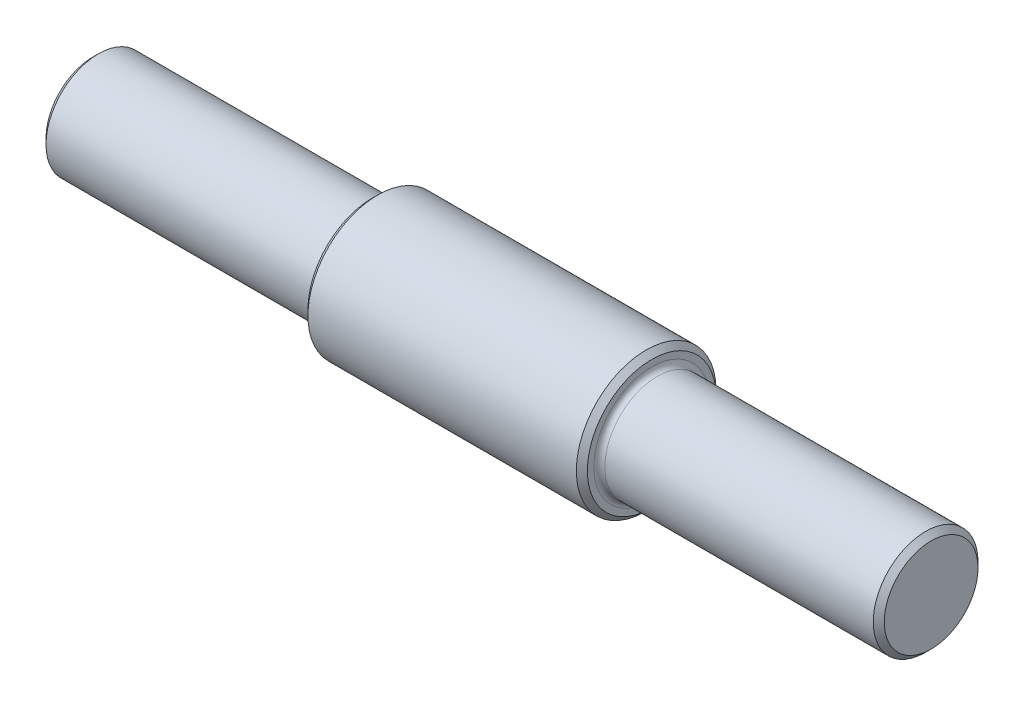
ISO-10303-21;
HEADER;
FILE_DESCRIPTION(('STEP AP214'),'2;1');
FILE_NAME('part.step','',(''),(''),'','','');
FILE_SCHEMA(('AUTOMOTIVE_DESIGN { 1 0 10303 214 1 1 1 1 }'));
ENDSEC;
DATA;
#1=APPLICATION_CONTEXT('core data for automotive mechanical design processes');
#2=APPLICATION_PROTOCOL_DEFINITION('international standard','automotive_design',2000,#1);
#3=PRODUCT_CONTEXT('',#1,'mechanical');
#4=PRODUCT('Part','Part','',(#3));
#5=PRODUCT_RELATED_PRODUCT_CATEGORY('part','',(#4));
#6=PRODUCT_DEFINITION_FORMATION('','',#4);
#7=PRODUCT_DEFINITION_CONTEXT('part definition',#1,'design');
#8=PRODUCT_DEFINITION('design','',#6,#7);
#9=PRODUCT_DEFINITION_SHAPE('','',#8);
#10=(LENGTH_UNIT() NAMED_UNIT(*) SI_UNIT(.MILLI.,.METRE.));
#11=(NAMED_UNIT(*) PLANE_ANGLE_UNIT() SI_UNIT($,.RADIAN.));
#12=(NAMED_UNIT(*) SI_UNIT($,.STERADIAN.) SOLID_ANGLE_UNIT());
#13=UNCERTAINTY_MEASURE_WITH_UNIT(LENGTH_MEASURE(1.E-05),#10,'distance_accuracy_value','');
#14=(GEOMETRIC_REPRESENTATION_CONTEXT(3) GLOBAL_UNCERTAINTY_ASSIGNED_CONTEXT((#13)) GLOBAL_UNIT_ASSIGNED_CONTEXT((#10,
#11,#12)) REPRESENTATION_CONTEXT('',''));
#15=CARTESIAN_POINT('',(0.,0.,0.));
#16=DIRECTION('',(0.,0.,1.));
#17=DIRECTION('',(1.,0.,0.));
#18=AXIS2_PLACEMENT_3D('',#15,#16,#17);
#19=CARTESIAN_POINT('',(25.4,0.,0.));
#20=DIRECTION('',(-1.,0.,0.));
#21=DIRECTION('',(0.,0.,1.));
#22=AXIS2_PLACEMENT_3D('',#19,#20,#21);
#23=CYLINDRICAL_SURFACE('',#22,12.7);
#24=CARTESIAN_POINT('',(24.4,0.,0.));
#25=DIRECTION('',(1.,0.,0.));
#26=DIRECTION('',(0.,0.,-1.));
#27=AXIS2_PLACEMENT_3D('',#24,#25,#26);
#28=CIRCLE('',#27,12.7);
#29=CARTESIAN_POINT('',(24.4,0.,-12.7));
#30=VERTEX_POINT('',#29);
#31=EDGE_CURVE('E37',#30,#30,#28,.F.);
#32=ORIENTED_EDGE('',*,*,#31,.T.);
#33=EDGE_LOOP('',(#32));
#34=FACE_BOUND('',#33,.T.);
#35=CARTESIAN_POINT('',(-24.4,0.,0.));
#36=DIRECTION('',(1.,0.,0.));
#37=DIRECTION('',(0.,0.,-1.));
#38=AXIS2_PLACEMENT_3D('',#35,#36,#37);
#39=CIRCLE('',#38,12.7);
#40=CARTESIAN_POINT('',(-24.4,0.,-12.7));
#41=VERTEX_POINT('',#40);
#42=EDGE_CURVE('E41',#41,#41,#39,.T.);
#43=ORIENTED_EDGE('',*,*,#42,.T.);
#44=EDGE_LOOP('',(#43));
#45=FACE_BOUND('',#44,.T.);
#46=ADVANCED_FACE('F30',(#34,#45),#23,.T.);
#47=CARTESIAN_POINT('',(25.4,0.,0.));
#48=DIRECTION('',(1.,0.,0.));
#49=DIRECTION('',(0.,0.,-1.));
#50=AXIS2_PLACEMENT_3D('',#47,#48,#49);
#51=PLANE('',#50);
#52=CARTESIAN_POINT('',(25.4,0.,0.));
#53=DIRECTION('',(1.,0.,0.));
#54=DIRECTION('',(0.,0.,-1.));
#55=AXIS2_PLACEMENT_3D('',#52,#53,#54);
#56=CIRCLE('',#55,11.7);
#57=CARTESIAN_POINT('',(25.4,0.,-11.7));
#58=VERTEX_POINT('',#57);
#59=EDGE_CURVE('E45',#58,#58,#56,.T.);
#60=ORIENTED_EDGE('',*,*,#59,.T.);
#61=EDGE_LOOP('',(#60));
#62=FACE_BOUND('',#61,.T.);
#63=CARTESIAN_POINT('',(25.4,0.,0.));
#64=DIRECTION('',(1.,0.,0.));
#65=DIRECTION('',(0.,0.,-1.));
#66=AXIS2_PLACEMENT_3D('',#63,#64,#65);
#67=CIRCLE('',#66,10.525);
#68=CARTESIAN_POINT('',(25.4,0.,-10.525));
#69=VERTEX_POINT('',#68);
#70=EDGE_CURVE('E68',#69,#69,#67,.F.);
#71=ORIENTED_EDGE('',*,*,#70,.T.);
#72=EDGE_LOOP('',(#71));
#73=FACE_BOUND('',#72,.T.);
#74=ADVANCED_FACE('F96',(#62,#73),#51,.T.);
#75=CARTESIAN_POINT('',(-25.4,0.,0.));
#76=DIRECTION('',(1.,0.,0.));
#77=DIRECTION('',(0.,0.,-1.));
#78=AXIS2_PLACEMENT_3D('',#75,#76,#77);
#79=PLANE('',#78);
#80=CARTESIAN_POINT('',(-25.4,0.,0.));
#81=DIRECTION('',(1.,0.,0.));
#82=DIRECTION('',(0.,0.,-1.));
#83=AXIS2_PLACEMENT_3D('',#80,#81,#82);
#84=CIRCLE('',#83,11.7);
#85=CARTESIAN_POINT('',(-25.4,0.,-11.7));
#86=VERTEX_POINT('',#85);
#87=EDGE_CURVE('E10',#86,#86,#84,.F.);
#88=ORIENTED_EDGE('',*,*,#87,.T.);
#89=EDGE_LOOP('',(#88));
#90=FACE_BOUND('',#89,.T.);
#91=CARTESIAN_POINT('',(-25.4,0.,0.));
#92=DIRECTION('',(1.,0.,0.));
#93=DIRECTION('',(0.,0.,-1.));
#94=AXIS2_PLACEMENT_3D('',#91,#92,#93);
#95=CIRCLE('',#94,10.525);
#96=CARTESIAN_POINT('',(-25.4,0.,-10.525));
#97=VERTEX_POINT('',#96);
#98=EDGE_CURVE('E65',#97,#97,#95,.T.);
#99=ORIENTED_EDGE('',*,*,#98,.T.);
#100=EDGE_LOOP('',(#99));
#101=FACE_BOUND('',#100,.T.);
#102=ADVANCED_FACE('F100',(#90,#101),#79,.F.);
#103=CARTESIAN_POINT('',(76.2,0.,0.));
#104=DIRECTION('',(-1.,0.,0.));
#105=DIRECTION('',(0.,0.,1.));
#106=AXIS2_PLACEMENT_3D('',#103,#104,#105);
#107=CYLINDRICAL_SURFACE('',#106,9.525);
#108=CARTESIAN_POINT('',(75.2,0.,0.));
#109=DIRECTION('',(1.,0.,0.));
#110=DIRECTION('',(0.,0.,-1.));
#111=AXIS2_PLACEMENT_3D('',#108,#109,#110);
#112=CIRCLE('',#111,9.525);
#113=CARTESIAN_POINT('',(75.2,0.,-9.525));
#114=VERTEX_POINT('',#113);
#115=EDGE_CURVE('E50',#114,#114,#112,.F.);
#116=ORIENTED_EDGE('',*,*,#115,.T.);
#117=EDGE_LOOP('',(#116));
#118=FACE_BOUND('',#117,.T.);
#119=CARTESIAN_POINT('',(26.4,0.,0.));
#120=DIRECTION('',(1.,0.,0.));
#121=DIRECTION('',(0.,0.,-1.));
#122=AXIS2_PLACEMENT_3D('',#119,#120,#121);
#123=CIRCLE('',#122,9.525);
#124=CARTESIAN_POINT('',(26.4,0.,-9.525));
#125=VERTEX_POINT('',#124);
#126=EDGE_CURVE('E71',#125,#125,#123,.T.);
#127=ORIENTED_EDGE('',*,*,#126,.T.);
#128=EDGE_LOOP('',(#127));
#129=FACE_BOUND('',#128,.T.);
#130=ADVANCED_FACE('F75',(#118,#129),#107,.T.);
#131=CARTESIAN_POINT('',(76.2,0.,0.));
#132=DIRECTION('',(1.,0.,0.));
#133=DIRECTION('',(0.,0.,-1.));
#134=AXIS2_PLACEMENT_3D('',#131,#132,#133);
#135=PLANE('',#134);
#136=CARTESIAN_POINT('',(76.2,0.,0.));
#137=DIRECTION('',(1.,0.,0.));
#138=DIRECTION('',(0.,0.,-1.));
#139=AXIS2_PLACEMENT_3D('',#136,#137,#138);
#140=CIRCLE('',#139,8.52499999999998);
#141=CARTESIAN_POINT('',(76.2,0.,-8.52499999999998));
#142=VERTEX_POINT('',#141);
#143=EDGE_CURVE('E53',#142,#142,#140,.T.);
#144=ORIENTED_EDGE('',*,*,#143,.T.);
#145=EDGE_LOOP('',(#144));
#146=FACE_BOUND('',#145,.T.);
#147=ADVANCED_FACE('F80',(#146),#135,.T.);
#148=CARTESIAN_POINT('',(26.4,0.,0.));
#149=DIRECTION('',(1.,0.,0.));
#150=DIRECTION('',(0.,0.,-1.));
#151=AXIS2_PLACEMENT_3D('',#148,#149,#150);
#152=TOROIDAL_SURFACE('',#151,10.525,1.);
#153=ORIENTED_EDGE('',*,*,#70,.F.);
#154=EDGE_LOOP('',(#153));
#155=FACE_BOUND('',#154,.T.);
#156=ORIENTED_EDGE('',*,*,#126,.F.);
#157=EDGE_LOOP('',(#156));
#158=FACE_BOUND('',#157,.T.);
#159=ADVANCED_FACE('F77',(#155,#158),#152,.F.);
#160=CARTESIAN_POINT('',(-76.2,0.,0.));
#161=DIRECTION('',(1.,0.,0.));
#162=DIRECTION('',(0.,0.,-1.));
#163=AXIS2_PLACEMENT_3D('',#160,#161,#162);
#164=CYLINDRICAL_SURFACE('',#163,9.525);
#165=CARTESIAN_POINT('',(-75.2,0.,0.));
#166=DIRECTION('',(-1.,0.,0.));
#167=DIRECTION('',(0.,0.,1.));
#168=AXIS2_PLACEMENT_3D('',#165,#166,#167);
#169=CIRCLE('',#168,9.525);
#170=CARTESIAN_POINT('',(-75.2,0.,9.525));
#171=VERTEX_POINT('',#170);
#172=EDGE_CURVE('E59',#171,#171,#169,.F.);
#173=ORIENTED_EDGE('',*,*,#172,.T.);
#174=EDGE_LOOP('',(#173));
#175=FACE_BOUND('',#174,.T.);
#176=CARTESIAN_POINT('',(-26.4,0.,0.));
#177=DIRECTION('',(1.,0.,0.));
#178=DIRECTION('',(0.,0.,-1.));
#179=AXIS2_PLACEMENT_3D('',#176,#177,#178);
#180=CIRCLE('',#179,9.525);
#181=CARTESIAN_POINT('',(-26.4,0.,-9.525));
#182=VERTEX_POINT('',#181);
#183=EDGE_CURVE('E62',#182,#182,#180,.F.);
#184=ORIENTED_EDGE('',*,*,#183,.T.);
#185=EDGE_LOOP('',(#184));
#186=FACE_BOUND('',#185,.T.);
#187=ADVANCED_FACE('F79',(#175,#186),#164,.T.);
#188=CARTESIAN_POINT('',(-76.2,0.,0.));
#189=DIRECTION('',(-1.,0.,0.));
#190=DIRECTION('',(0.,0.,-1.));
#191=AXIS2_PLACEMENT_3D('',#188,#189,#190);
#192=PLANE('',#191);
#193=CARTESIAN_POINT('',(-76.2,0.,0.));
#194=DIRECTION('',(-1.,0.,0.));
#195=DIRECTION('',(0.,0.,1.));
#196=AXIS2_PLACEMENT_3D('',#193,#194,#195);
#197=CIRCLE('',#196,8.52500000000001);
#198=CARTESIAN_POINT('',(-76.2,0.,8.52500000000001));
#199=VERTEX_POINT('',#198);
#200=EDGE_CURVE('E56',#199,#199,#197,.T.);
#201=ORIENTED_EDGE('',*,*,#200,.T.);
#202=EDGE_LOOP('',(#201));
#203=FACE_BOUND('',#202,.T.);
#204=ADVANCED_FACE('F87',(#203),#192,.T.);
#205=CARTESIAN_POINT('',(-26.4,0.,0.));
#206=DIRECTION('',(1.,0.,0.));
#207=DIRECTION('',(0.,0.,-1.));
#208=AXIS2_PLACEMENT_3D('',#205,#206,#207);
#209=TOROIDAL_SURFACE('',#208,10.525,1.);
#210=ORIENTED_EDGE('',*,*,#183,.F.);
#211=EDGE_LOOP('',(#210));
#212=FACE_BOUND('',#211,.T.);
#213=ORIENTED_EDGE('',*,*,#98,.F.);
#214=EDGE_LOOP('',(#213));
#215=FACE_BOUND('',#214,.T.);
#216=ADVANCED_FACE('F111',(#212,#215),#209,.F.);
#217=CARTESIAN_POINT('',(-75.2,0.,0.));
#218=DIRECTION('',(1.,0.,0.));
#219=DIRECTION('',(0.,0.,-1.));
#220=AXIS2_PLACEMENT_3D('',#217,#218,#219);
#221=CONICAL_SURFACE('',#220,9.525,0.785398163397446);
#222=ORIENTED_EDGE('',*,*,#200,.F.);
#223=EDGE_LOOP('',(#222));
#224=FACE_BOUND('',#223,.T.);
#225=ORIENTED_EDGE('',*,*,#172,.F.);
#226=EDGE_LOOP('',(#225));
#227=FACE_BOUND('',#226,.T.);
#228=ADVANCED_FACE('F116',(#224,#227),#221,.T.);
#229=CARTESIAN_POINT('',(76.2,0.,0.));
#230=DIRECTION('',(-1.,0.,0.));
#231=DIRECTION('',(0.,0.,1.));
#232=AXIS2_PLACEMENT_3D('',#229,#230,#231);
#233=CONICAL_SURFACE('',#232,8.52499999999998,0.785398163397446);
#234=ORIENTED_EDGE('',*,*,#115,.F.);
#235=EDGE_LOOP('',(#234));
#236=FACE_BOUND('',#235,.T.);
#237=ORIENTED_EDGE('',*,*,#143,.F.);
#238=EDGE_LOOP('',(#237));
#239=FACE_BOUND('',#238,.T.);
#240=ADVANCED_FACE('F122',(#236,#239),#233,.T.);
#241=CARTESIAN_POINT('',(25.4,0.,0.));
#242=DIRECTION('',(-1.,0.,0.));
#243=DIRECTION('',(0.,0.,1.));
#244=AXIS2_PLACEMENT_3D('',#241,#242,#243);
#245=CONICAL_SURFACE('',#244,11.7,0.785398163397447);
#246=ORIENTED_EDGE('',*,*,#31,.F.);
#247=EDGE_LOOP('',(#246));
#248=FACE_BOUND('',#247,.T.);
#249=ORIENTED_EDGE('',*,*,#59,.F.);
#250=EDGE_LOOP('',(#249));
#251=FACE_BOUND('',#250,.T.);
#252=ADVANCED_FACE('F133',(#248,#251),#245,.T.);
#253=CARTESIAN_POINT('',(-24.4,0.,0.));
#254=DIRECTION('',(1.,0.,0.));
#255=DIRECTION('',(0.,0.,-1.));
#256=AXIS2_PLACEMENT_3D('',#253,#254,#255);
#257=CONICAL_SURFACE('',#256,12.7,0.785398163397442);
#258=ORIENTED_EDGE('',*,*,#87,.F.);
#259=EDGE_LOOP('',(#258));
#260=FACE_BOUND('',#259,.T.);
#261=ORIENTED_EDGE('',*,*,#42,.F.);
#262=EDGE_LOOP('',(#261));
#263=FACE_BOUND('',#262,.T.);
#264=ADVANCED_FACE('F32',(#260,#263),#257,.T.);
#265=CLOSED_SHELL('',(#46,#74,#102,#130,#147,#159,#187,#204,#216,#228,#240,#252,#264));
#266=MANIFOLD_SOLID_BREP('B2',#265);
#267=ADVANCED_BREP_SHAPE_REPRESENTATION('',(#18,#266),#14);
#268=SHAPE_DEFINITION_REPRESENTATION(#9,#267);
ENDSEC;
END-ISO-10303-21;
